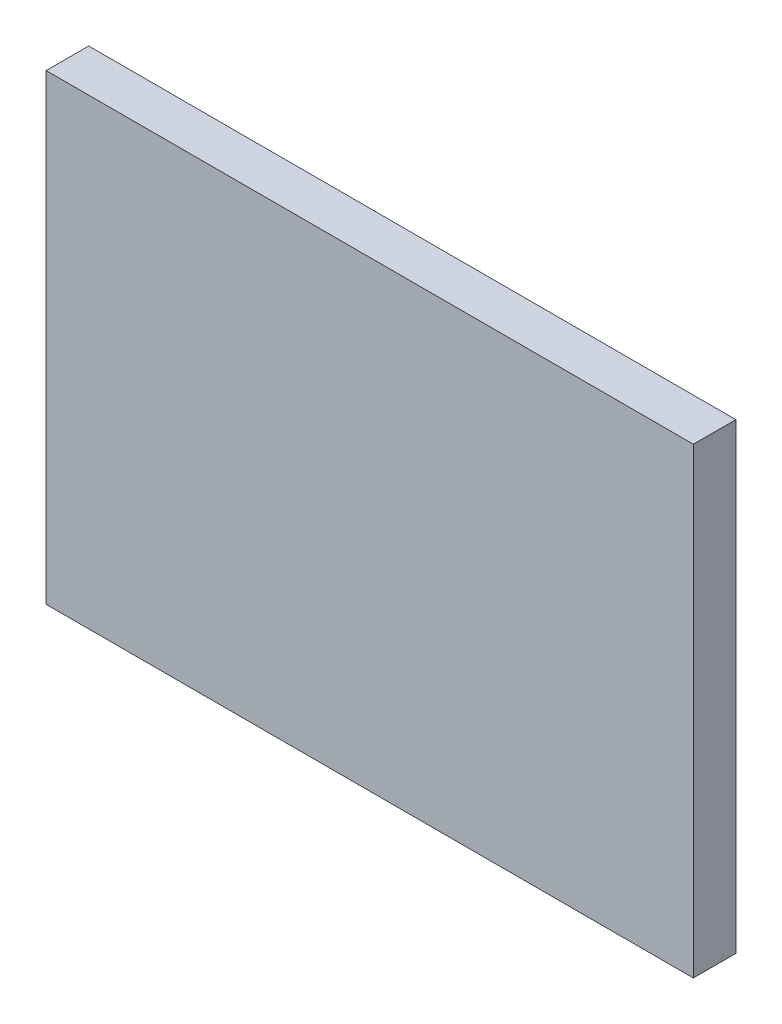
ISO-10303-21;
HEADER;
FILE_DESCRIPTION(('STEP AP214'),'2;1');
FILE_NAME('part.step','',(''),(''),'','','');
FILE_SCHEMA(('AUTOMOTIVE_DESIGN { 1 0 10303 214 1 1 1 1 }'));
ENDSEC;
DATA;
#1=APPLICATION_CONTEXT('core data for automotive mechanical design processes');
#2=APPLICATION_PROTOCOL_DEFINITION('international standard','automotive_design',2000,#1);
#3=PRODUCT_CONTEXT('',#1,'mechanical');
#4=PRODUCT('Part','Part','',(#3));
#5=PRODUCT_RELATED_PRODUCT_CATEGORY('part','',(#4));
#6=PRODUCT_DEFINITION_FORMATION('','',#4);
#7=PRODUCT_DEFINITION_CONTEXT('part definition',#1,'design');
#8=PRODUCT_DEFINITION('design','',#6,#7);
#9=PRODUCT_DEFINITION_SHAPE('','',#8);
#10=(LENGTH_UNIT() NAMED_UNIT(*) SI_UNIT(.MILLI.,.METRE.));
#11=(NAMED_UNIT(*) PLANE_ANGLE_UNIT() SI_UNIT($,.RADIAN.));
#12=(NAMED_UNIT(*) SI_UNIT($,.STERADIAN.) SOLID_ANGLE_UNIT());
#13=UNCERTAINTY_MEASURE_WITH_UNIT(LENGTH_MEASURE(1.E-05),#10,'distance_accuracy_value','');
#14=(GEOMETRIC_REPRESENTATION_CONTEXT(3) GLOBAL_UNCERTAINTY_ASSIGNED_CONTEXT((#13)) GLOBAL_UNIT_ASSIGNED_CONTEXT((#10,
#11,#12)) REPRESENTATION_CONTEXT('',''));
#15=CARTESIAN_POINT('',(0.,0.,0.));
#16=DIRECTION('',(0.,0.,1.));
#17=DIRECTION('',(1.,0.,0.));
#18=AXIS2_PLACEMENT_3D('',#15,#16,#17);
#19=CARTESIAN_POINT('',(91.1149839422837,74.0632418345266,2.3));
#20=DIRECTION('',(1.,0.,0.));
#21=DIRECTION('',(0.,0.,-1.));
#22=AXIS2_PLACEMENT_3D('',#19,#20,#21);
#23=PLANE('',#22);
#24=DIRECTION('',(0.,-1.,0.));
#25=VECTOR('',#24,1.);
#26=CARTESIAN_POINT('',(91.1149839422837,74.0632418345266,0.));
#27=LINE('',#26,#25);
#28=CARTESIAN_POINT('',(91.1149839422837,74.0632418345266,0.));
#29=VERTEX_POINT('',#28);
#30=CARTESIAN_POINT('',(91.1149839422837,49.0632418345266,0.));
#31=VERTEX_POINT('',#30);
#32=EDGE_CURVE('E100',#29,#31,#27,.T.);
#33=ORIENTED_EDGE('',*,*,#32,.T.);
#34=DIRECTION('',(0.,0.,-1.));
#35=VECTOR('',#34,1.);
#36=CARTESIAN_POINT('',(91.1149839422837,49.0632418345266,2.3));
#37=LINE('',#36,#35);
#38=CARTESIAN_POINT('',(91.1149839422837,49.0632418345266,2.3));
#39=VERTEX_POINT('',#38);
#40=EDGE_CURVE('E11',#39,#31,#37,.T.);
#41=ORIENTED_EDGE('',*,*,#40,.F.);
#42=DIRECTION('',(0.,-1.,0.));
#43=VECTOR('',#42,1.);
#44=CARTESIAN_POINT('',(91.1149839422837,74.0632418345266,2.3));
#45=LINE('',#44,#43);
#46=CARTESIAN_POINT('',(91.1149839422837,74.0632418345266,2.3));
#47=VERTEX_POINT('',#46);
#48=EDGE_CURVE('E88',#47,#39,#45,.T.);
#49=ORIENTED_EDGE('',*,*,#48,.F.);
#50=DIRECTION('',(0.,0.,-1.));
#51=VECTOR('',#50,1.);
#52=CARTESIAN_POINT('',(91.1149839422837,74.0632418345266,2.3));
#53=LINE('',#52,#51);
#54=EDGE_CURVE('E96',#47,#29,#53,.T.);
#55=ORIENTED_EDGE('',*,*,#54,.T.);
#56=EDGE_LOOP('',(#33,#41,#49,#55));
#57=FACE_BOUND('',#56,.T.);
#58=ADVANCED_FACE('F37',(#57),#23,.F.);
#59=CARTESIAN_POINT('',(91.1149839422837,49.0632418345266,2.3));
#60=DIRECTION('',(0.,1.,0.));
#61=DIRECTION('',(-1.,0.,0.));
#62=AXIS2_PLACEMENT_3D('',#59,#60,#61);
#63=PLANE('',#62);
#64=DIRECTION('',(1.,0.,0.));
#65=VECTOR('',#64,1.);
#66=CARTESIAN_POINT('',(91.1149839422837,49.0632418345266,0.));
#67=LINE('',#66,#65);
#68=CARTESIAN_POINT('',(126.114983942284,49.0632418345266,0.));
#69=VERTEX_POINT('',#68);
#70=EDGE_CURVE('E92',#31,#69,#67,.T.);
#71=ORIENTED_EDGE('',*,*,#70,.T.);
#72=DIRECTION('',(0.,0.,-1.));
#73=VECTOR('',#72,1.);
#74=CARTESIAN_POINT('',(126.114983942284,49.0632418345266,2.3));
#75=LINE('',#74,#73);
#76=CARTESIAN_POINT('',(126.114983942284,49.0632418345266,2.3));
#77=VERTEX_POINT('',#76);
#78=EDGE_CURVE('E45',#77,#69,#75,.T.);
#79=ORIENTED_EDGE('',*,*,#78,.F.);
#80=DIRECTION('',(1.,0.,0.));
#81=VECTOR('',#80,1.);
#82=CARTESIAN_POINT('',(91.1149839422837,49.0632418345266,2.3));
#83=LINE('',#82,#81);
#84=EDGE_CURVE('E83',#39,#77,#83,.T.);
#85=ORIENTED_EDGE('',*,*,#84,.F.);
#86=ORIENTED_EDGE('',*,*,#40,.T.);
#87=EDGE_LOOP('',(#71,#79,#85,#86));
#88=FACE_BOUND('',#87,.T.);
#89=ADVANCED_FACE('F91',(#88),#63,.F.);
#90=CARTESIAN_POINT('',(126.114983942284,74.0632418345266,2.3));
#91=DIRECTION('',(-1.,0.,0.));
#92=DIRECTION('',(0.,-1.,0.));
#93=AXIS2_PLACEMENT_3D('',#90,#91,#92);
#94=PLANE('',#93);
#95=DIRECTION('',(0.,1.,0.));
#96=VECTOR('',#95,1.);
#97=CARTESIAN_POINT('',(126.114983942284,74.0632418345266,0.));
#98=LINE('',#97,#96);
#99=CARTESIAN_POINT('',(126.114983942284,74.0632418345266,0.));
#100=VERTEX_POINT('',#99);
#101=EDGE_CURVE('E70',#69,#100,#98,.T.);
#102=ORIENTED_EDGE('',*,*,#101,.T.);
#103=DIRECTION('',(0.,0.,-1.));
#104=VECTOR('',#103,1.);
#105=CARTESIAN_POINT('',(126.114983942284,74.0632418345266,2.3));
#106=LINE('',#105,#104);
#107=CARTESIAN_POINT('',(126.114983942284,74.0632418345266,2.3));
#108=VERTEX_POINT('',#107);
#109=EDGE_CURVE('E93',#108,#100,#106,.T.);
#110=ORIENTED_EDGE('',*,*,#109,.F.);
#111=DIRECTION('',(0.,1.,0.));
#112=VECTOR('',#111,1.);
#113=CARTESIAN_POINT('',(126.114983942284,74.0632418345266,2.3));
#114=LINE('',#113,#112);
#115=EDGE_CURVE('E86',#77,#108,#114,.T.);
#116=ORIENTED_EDGE('',*,*,#115,.F.);
#117=ORIENTED_EDGE('',*,*,#78,.T.);
#118=EDGE_LOOP('',(#102,#110,#116,#117));
#119=FACE_BOUND('',#118,.T.);
#120=ADVANCED_FACE('F94',(#119),#94,.F.);
#121=CARTESIAN_POINT('',(91.1149839422837,74.0632418345266,2.3));
#122=DIRECTION('',(0.,-1.,0.));
#123=DIRECTION('',(1.,0.,0.));
#124=AXIS2_PLACEMENT_3D('',#121,#122,#123);
#125=PLANE('',#124);
#126=DIRECTION('',(-1.,0.,0.));
#127=VECTOR('',#126,1.);
#128=CARTESIAN_POINT('',(91.1149839422837,74.0632418345266,0.));
#129=LINE('',#128,#127);
#130=EDGE_CURVE('E76',#100,#29,#129,.T.);
#131=ORIENTED_EDGE('',*,*,#130,.T.);
#132=ORIENTED_EDGE('',*,*,#54,.F.);
#133=DIRECTION('',(-1.,0.,0.));
#134=VECTOR('',#133,1.);
#135=CARTESIAN_POINT('',(91.1149839422837,74.0632418345266,2.3));
#136=LINE('',#135,#134);
#137=EDGE_CURVE('E53',#108,#47,#136,.T.);
#138=ORIENTED_EDGE('',*,*,#137,.F.);
#139=ORIENTED_EDGE('',*,*,#109,.T.);
#140=EDGE_LOOP('',(#131,#132,#138,#139));
#141=FACE_BOUND('',#140,.T.);
#142=ADVANCED_FACE('F107',(#141),#125,.F.);
#143=CARTESIAN_POINT('',(0.,0.,2.3));
#144=DIRECTION('',(0.,0.,1.));
#145=DIRECTION('',(1.,0.,0.));
#146=AXIS2_PLACEMENT_3D('',#143,#144,#145);
#147=PLANE('',#146);
#148=ORIENTED_EDGE('',*,*,#48,.T.);
#149=ORIENTED_EDGE('',*,*,#84,.T.);
#150=ORIENTED_EDGE('',*,*,#115,.T.);
#151=ORIENTED_EDGE('',*,*,#137,.T.);
#152=EDGE_LOOP('',(#148,#149,#150,#151));
#153=FACE_BOUND('',#152,.T.);
#154=ADVANCED_FACE('F84',(#153),#147,.T.);
#155=CARTESIAN_POINT('',(0.,0.,0.));
#156=DIRECTION('',(0.,0.,1.));
#157=DIRECTION('',(1.,0.,0.));
#158=AXIS2_PLACEMENT_3D('',#155,#156,#157);
#159=PLANE('',#158);
#160=ORIENTED_EDGE('',*,*,#32,.F.);
#161=ORIENTED_EDGE('',*,*,#130,.F.);
#162=ORIENTED_EDGE('',*,*,#101,.F.);
#163=ORIENTED_EDGE('',*,*,#70,.F.);
#164=EDGE_LOOP('',(#160,#161,#162,#163));
#165=FACE_BOUND('',#164,.T.);
#166=ADVANCED_FACE('F110',(#165),#159,.F.);
#167=CLOSED_SHELL('',(#58,#89,#120,#142,#154,#166));
#168=MANIFOLD_SOLID_BREP('B2',#167);
#169=ADVANCED_BREP_SHAPE_REPRESENTATION('',(#18,#168),#14);
#170=SHAPE_DEFINITION_REPRESENTATION(#9,#169);
ENDSEC;
END-ISO-10303-21;
